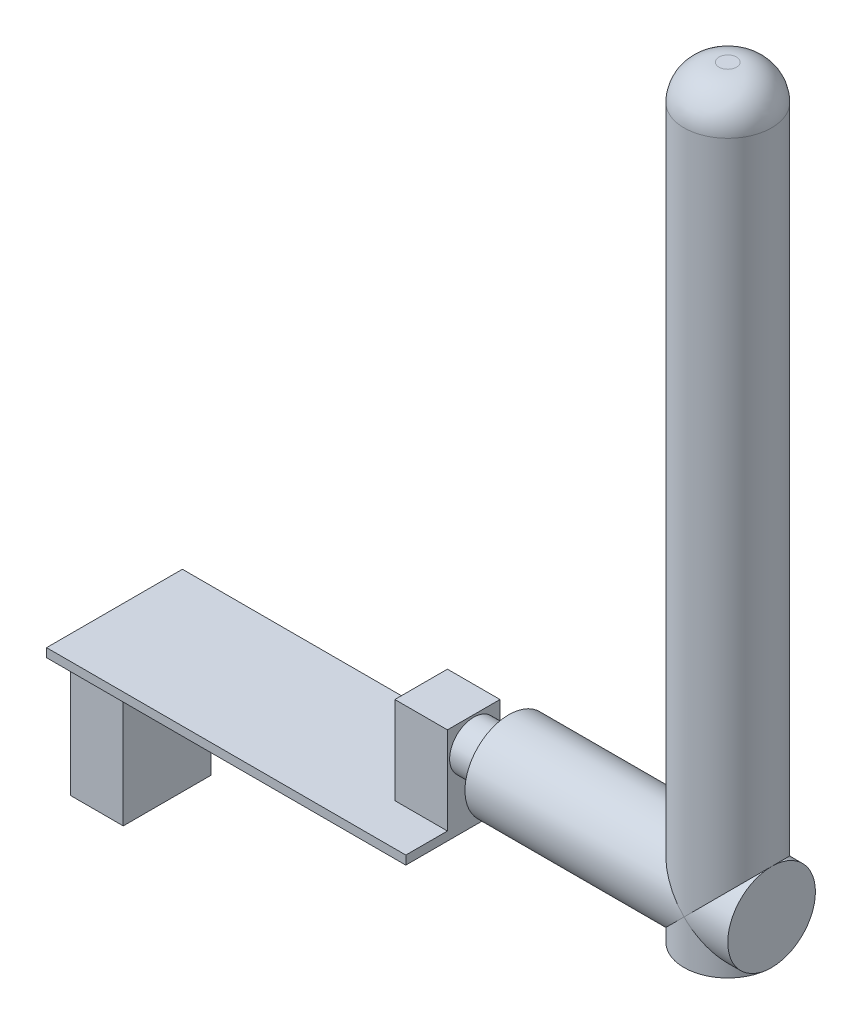
ISO-10303-21;
HEADER;
FILE_DESCRIPTION(('STEP AP214'),'2;1');
FILE_NAME('part.step','',(''),(''),'','','');
FILE_SCHEMA(('AUTOMOTIVE_DESIGN { 1 0 10303 214 1 1 1 1 }'));
ENDSEC;
DATA;
#1=APPLICATION_CONTEXT('core data for automotive mechanical design processes');
#2=APPLICATION_PROTOCOL_DEFINITION('international standard','automotive_design',2000,#1);
#3=PRODUCT_CONTEXT('',#1,'mechanical');
#4=PRODUCT('Part','Part','',(#3));
#5=PRODUCT_RELATED_PRODUCT_CATEGORY('part','',(#4));
#6=PRODUCT_DEFINITION_FORMATION('','',#4);
#7=PRODUCT_DEFINITION_CONTEXT('part definition',#1,'design');
#8=PRODUCT_DEFINITION('design','',#6,#7);
#9=PRODUCT_DEFINITION_SHAPE('','',#8);
#10=(LENGTH_UNIT() NAMED_UNIT(*) SI_UNIT(.MILLI.,.METRE.));
#11=(NAMED_UNIT(*) PLANE_ANGLE_UNIT() SI_UNIT($,.RADIAN.));
#12=(NAMED_UNIT(*) SI_UNIT($,.STERADIAN.) SOLID_ANGLE_UNIT());
#13=UNCERTAINTY_MEASURE_WITH_UNIT(LENGTH_MEASURE(1.E-05),#10,'distance_accuracy_value','');
#14=(GEOMETRIC_REPRESENTATION_CONTEXT(3) GLOBAL_UNCERTAINTY_ASSIGNED_CONTEXT((#13)) GLOBAL_UNIT_ASSIGNED_CONTEXT((#10,
#11,#12)) REPRESENTATION_CONTEXT('',''));
#15=CARTESIAN_POINT('',(0.,0.,0.));
#16=DIRECTION('',(0.,0.,1.));
#17=DIRECTION('',(1.,0.,0.));
#18=AXIS2_PLACEMENT_3D('',#15,#16,#17);
#19=CARTESIAN_POINT('',(0.,-1.,0.));
#20=DIRECTION('',(0.,1.,0.));
#21=DIRECTION('',(0.,0.,1.));
#22=AXIS2_PLACEMENT_3D('',#19,#20,#21);
#23=PLANE('',#22);
#24=DIRECTION('',(1.,0.,0.));
#25=VECTOR('',#24,1.);
#26=CARTESIAN_POINT('',(-20.5,-1.,-5.));
#27=LINE('',#26,#25);
#28=CARTESIAN_POINT('',(-20.5,-1.,-5.));
#29=VERTEX_POINT('',#28);
#30=CARTESIAN_POINT('',(-14.5,-1.,-5.));
#31=VERTEX_POINT('',#30);
#32=EDGE_CURVE('E177',#29,#31,#27,.T.);
#33=ORIENTED_EDGE('',*,*,#32,.F.);
#34=DIRECTION('',(0.,0.,1.));
#35=VECTOR('',#34,1.);
#36=CARTESIAN_POINT('',(-20.5,-1.,-7.75));
#37=LINE('',#36,#35);
#38=CARTESIAN_POINT('',(-20.5,-1.,-7.75));
#39=VERTEX_POINT('',#38);
#40=EDGE_CURVE('E281',#39,#29,#37,.T.);
#41=ORIENTED_EDGE('',*,*,#40,.F.);
#42=DIRECTION('',(-1.,0.,0.));
#43=VECTOR('',#42,1.);
#44=CARTESIAN_POINT('',(-20.5,-1.,-7.75));
#45=LINE('',#44,#43);
#46=CARTESIAN_POINT('',(20.5,-1.,-7.75));
#47=VERTEX_POINT('',#46);
#48=EDGE_CURVE('E275',#47,#39,#45,.T.);
#49=ORIENTED_EDGE('',*,*,#48,.F.);
#50=DIRECTION('',(0.,0.,-1.));
#51=VECTOR('',#50,1.);
#52=CARTESIAN_POINT('',(20.5,-1.,-7.75));
#53=LINE('',#52,#51);
#54=CARTESIAN_POINT('',(20.5,-1.,7.75));
#55=VERTEX_POINT('',#54);
#56=EDGE_CURVE('E271',#55,#47,#53,.T.);
#57=ORIENTED_EDGE('',*,*,#56,.F.);
#58=DIRECTION('',(1.,0.,0.));
#59=VECTOR('',#58,1.);
#60=CARTESIAN_POINT('',(-20.5,-1.,7.75));
#61=LINE('',#60,#59);
#62=CARTESIAN_POINT('',(-20.5,-1.,7.75));
#63=VERTEX_POINT('',#62);
#64=EDGE_CURVE('E285',#63,#55,#61,.T.);
#65=ORIENTED_EDGE('',*,*,#64,.F.);
#66=CARTESIAN_POINT('',(-20.5,-1.,5.));
#67=VERTEX_POINT('',#66);
#68=EDGE_CURVE('E280',#67,#63,#37,.T.);
#69=ORIENTED_EDGE('',*,*,#68,.F.);
#70=DIRECTION('',(-1.,0.,0.));
#71=VECTOR('',#70,1.);
#72=CARTESIAN_POINT('',(-20.5,-1.,5.));
#73=LINE('',#72,#71);
#74=CARTESIAN_POINT('',(-14.5,-1.,5.));
#75=VERTEX_POINT('',#74);
#76=EDGE_CURVE('E74',#75,#67,#73,.T.);
#77=ORIENTED_EDGE('',*,*,#76,.F.);
#78=DIRECTION('',(0.,0.,1.));
#79=VECTOR('',#78,1.);
#80=CARTESIAN_POINT('',(-14.5,-1.,5.));
#81=LINE('',#80,#79);
#82=EDGE_CURVE('E69',#31,#75,#81,.T.);
#83=ORIENTED_EDGE('',*,*,#82,.F.);
#84=EDGE_LOOP('',(#33,#41,#49,#57,#65,#69,#77,#83));
#85=FACE_BOUND('',#84,.T.);
#86=ADVANCED_FACE('F53',(#85),#23,.F.);
#87=CARTESIAN_POINT('',(54.5,7.,0.));
#88=DIRECTION('',(-1.,0.,0.));
#89=DIRECTION('',(0.,0.,1.));
#90=AXIS2_PLACEMENT_3D('',#87,#88,#89);
#91=CYLINDRICAL_SURFACE('',#90,5.);
#92=CARTESIAN_POINT('',(24.5,7.,0.));
#93=DIRECTION('',(1.,0.,0.));
#94=DIRECTION('',(0.,0.,-1.));
#95=AXIS2_PLACEMENT_3D('',#92,#93,#94);
#96=CIRCLE('',#95,5.);
#97=CARTESIAN_POINT('',(24.5,7.,-5.));
#98=VERTEX_POINT('',#97);
#99=EDGE_CURVE('E218',#98,#98,#96,.T.);
#100=ORIENTED_EDGE('',*,*,#99,.T.);
#101=EDGE_LOOP('',(#100));
#102=FACE_BOUND('',#101,.T.);
#103=CARTESIAN_POINT('',(49.5,7.,0.));
#104=DIRECTION('',(-0.707106781186547,-0.707106781186547,0.));
#105=DIRECTION('',(-0.707106781186547,0.707106781186547,0.));
#106=AXIS2_PLACEMENT_3D('',#103,#104,#105);
#107=ELLIPSE('',#106,7.07106781186547,5.);
#108=CARTESIAN_POINT('',(49.5,7.,5.));
#109=VERTEX_POINT('',#108);
#110=CARTESIAN_POINT('',(49.5,7.,-5.));
#111=VERTEX_POINT('',#110);
#112=EDGE_CURVE('E203',#109,#111,#107,.T.);
#113=ORIENTED_EDGE('',*,*,#112,.T.);
#114=CARTESIAN_POINT('',(49.5,7.,0.));
#115=DIRECTION('',(-0.707106781186547,0.707106781186547,0.));
#116=DIRECTION('',(-0.707106781186547,-0.707106781186547,0.));
#117=AXIS2_PLACEMENT_3D('',#114,#115,#116);
#118=ELLIPSE('',#117,7.07106781186547,5.);
#119=CARTESIAN_POINT('',(44.5,2.,0.));
#120=VERTEX_POINT('',#119);
#121=EDGE_CURVE('E202',#111,#120,#118,.T.);
#122=ORIENTED_EDGE('',*,*,#121,.T.);
#123=EDGE_CURVE('E197',#120,#109,#118,.T.);
#124=ORIENTED_EDGE('',*,*,#123,.T.);
#125=EDGE_LOOP('',(#113,#122,#124));
#126=FACE_BOUND('',#125,.T.);
#127=ADVANCED_FACE('F333',(#102,#126),#91,.T.);
#128=CARTESIAN_POINT('',(20.5,-1.,-7.75));
#129=DIRECTION('',(1.,0.,0.));
#130=DIRECTION('',(0.,0.,-1.));
#131=AXIS2_PLACEMENT_3D('',#128,#129,#130);
#132=PLANE('',#131);
#133=CARTESIAN_POINT('',(20.5,7.,0.));
#134=DIRECTION('',(1.,0.,0.));
#135=DIRECTION('',(0.,0.,-1.));
#136=AXIS2_PLACEMENT_3D('',#133,#134,#135);
#137=CIRCLE('',#136,2.75);
#138=CARTESIAN_POINT('',(20.5,7.,-2.75));
#139=VERTEX_POINT('',#138);
#140=EDGE_CURVE('E216',#139,#139,#137,.T.);
#141=ORIENTED_EDGE('',*,*,#140,.F.);
#142=EDGE_LOOP('',(#141));
#143=FACE_BOUND('',#142,.T.);
#144=DIRECTION('',(0.,0.,-1.));
#145=VECTOR('',#144,1.);
#146=CARTESIAN_POINT('',(20.5,0.,-7.75));
#147=LINE('',#146,#145);
#148=CARTESIAN_POINT('',(20.5,0.,7.75));
#149=VERTEX_POINT('',#148);
#150=CARTESIAN_POINT('',(20.5,0.,3.));
#151=VERTEX_POINT('',#150);
#152=EDGE_CURVE('E290',#149,#151,#147,.T.);
#153=ORIENTED_EDGE('',*,*,#152,.F.);
#154=DIRECTION('',(0.,1.,0.));
#155=VECTOR('',#154,1.);
#156=CARTESIAN_POINT('',(20.5,-1.,7.75));
#157=LINE('',#156,#155);
#158=EDGE_CURVE('E304',#55,#149,#157,.T.);
#159=ORIENTED_EDGE('',*,*,#158,.F.);
#160=ORIENTED_EDGE('',*,*,#56,.T.);
#161=DIRECTION('',(0.,1.,0.));
#162=VECTOR('',#161,1.);
#163=CARTESIAN_POINT('',(20.5,-1.,-7.75));
#164=LINE('',#163,#162);
#165=CARTESIAN_POINT('',(20.5,0.,-7.75));
#166=VERTEX_POINT('',#165);
#167=EDGE_CURVE('E289',#47,#166,#164,.T.);
#168=ORIENTED_EDGE('',*,*,#167,.T.);
#169=CARTESIAN_POINT('',(20.5,0.,-3.));
#170=VERTEX_POINT('',#169);
#171=EDGE_CURVE('E270',#170,#166,#147,.T.);
#172=ORIENTED_EDGE('',*,*,#171,.F.);
#173=DIRECTION('',(0.,-1.,0.));
#174=VECTOR('',#173,1.);
#175=CARTESIAN_POINT('',(20.5,10.,-3.));
#176=LINE('',#175,#174);
#177=CARTESIAN_POINT('',(20.5,10.,-3.));
#178=VERTEX_POINT('',#177);
#179=EDGE_CURVE('E266',#178,#170,#176,.T.);
#180=ORIENTED_EDGE('',*,*,#179,.F.);
#181=DIRECTION('',(0.,0.,-1.));
#182=VECTOR('',#181,1.);
#183=CARTESIAN_POINT('',(20.5,10.,-3.));
#184=LINE('',#183,#182);
#185=CARTESIAN_POINT('',(20.5,10.,3.));
#186=VERTEX_POINT('',#185);
#187=EDGE_CURVE('E230',#186,#178,#184,.T.);
#188=ORIENTED_EDGE('',*,*,#187,.F.);
#189=DIRECTION('',(0.,-1.,0.));
#190=VECTOR('',#189,1.);
#191=CARTESIAN_POINT('',(20.5,10.,3.));
#192=LINE('',#191,#190);
#193=EDGE_CURVE('E244',#186,#151,#192,.T.);
#194=ORIENTED_EDGE('',*,*,#193,.T.);
#195=EDGE_LOOP('',(#153,#159,#160,#168,#172,#180,#188,#194));
#196=FACE_BOUND('',#195,.T.);
#197=ADVANCED_FACE('F340',(#143,#196),#132,.T.);
#198=CARTESIAN_POINT('',(-20.5,-1.,7.75));
#199=DIRECTION('',(0.,0.,1.));
#200=DIRECTION('',(1.,0.,0.));
#201=AXIS2_PLACEMENT_3D('',#198,#199,#200);
#202=PLANE('',#201);
#203=DIRECTION('',(1.,0.,0.));
#204=VECTOR('',#203,1.);
#205=CARTESIAN_POINT('',(-20.5,0.,7.75));
#206=LINE('',#205,#204);
#207=CARTESIAN_POINT('',(-20.5,0.,7.75));
#208=VERTEX_POINT('',#207);
#209=EDGE_CURVE('E276',#208,#149,#206,.T.);
#210=ORIENTED_EDGE('',*,*,#209,.F.);
#211=DIRECTION('',(0.,1.,0.));
#212=VECTOR('',#211,1.);
#213=CARTESIAN_POINT('',(-20.5,-1.,7.75));
#214=LINE('',#213,#212);
#215=EDGE_CURVE('E307',#63,#208,#214,.T.);
#216=ORIENTED_EDGE('',*,*,#215,.F.);
#217=ORIENTED_EDGE('',*,*,#64,.T.);
#218=ORIENTED_EDGE('',*,*,#158,.T.);
#219=EDGE_LOOP('',(#210,#216,#217,#218));
#220=FACE_BOUND('',#219,.T.);
#221=ADVANCED_FACE('F351',(#220),#202,.T.);
#222=CARTESIAN_POINT('',(-20.5,-1.,-7.75));
#223=DIRECTION('',(-1.,0.,0.));
#224=DIRECTION('',(0.,0.,1.));
#225=AXIS2_PLACEMENT_3D('',#222,#223,#224);
#226=PLANE('',#225);
#227=DIRECTION('',(0.,0.,1.));
#228=VECTOR('',#227,1.);
#229=CARTESIAN_POINT('',(-20.5,0.,-7.75));
#230=LINE('',#229,#228);
#231=CARTESIAN_POINT('',(-20.5,0.,-7.75));
#232=VERTEX_POINT('',#231);
#233=EDGE_CURVE('E297',#232,#208,#230,.T.);
#234=ORIENTED_EDGE('',*,*,#233,.F.);
#235=DIRECTION('',(0.,1.,0.));
#236=VECTOR('',#235,1.);
#237=CARTESIAN_POINT('',(-20.5,-1.,-7.75));
#238=LINE('',#237,#236);
#239=EDGE_CURVE('E310',#39,#232,#238,.T.);
#240=ORIENTED_EDGE('',*,*,#239,.F.);
#241=ORIENTED_EDGE('',*,*,#40,.T.);
#242=DIRECTION('',(0.,1.,0.));
#243=VECTOR('',#242,1.);
#244=CARTESIAN_POINT('',(-20.5,-16.,-5.));
#245=LINE('',#244,#243);
#246=CARTESIAN_POINT('',(-20.5,-16.,-5.));
#247=VERTEX_POINT('',#246);
#248=EDGE_CURVE('E188',#247,#29,#245,.T.);
#249=ORIENTED_EDGE('',*,*,#248,.F.);
#250=DIRECTION('',(0.,0.,-1.));
#251=VECTOR('',#250,1.);
#252=CARTESIAN_POINT('',(-20.5,-16.,5.));
#253=LINE('',#252,#251);
#254=CARTESIAN_POINT('',(-20.5,-16.,5.));
#255=VERTEX_POINT('',#254);
#256=EDGE_CURVE('E166',#255,#247,#253,.T.);
#257=ORIENTED_EDGE('',*,*,#256,.F.);
#258=DIRECTION('',(0.,1.,0.));
#259=VECTOR('',#258,1.);
#260=CARTESIAN_POINT('',(-20.5,-16.,5.));
#261=LINE('',#260,#259);
#262=EDGE_CURVE('E162',#255,#67,#261,.T.);
#263=ORIENTED_EDGE('',*,*,#262,.T.);
#264=ORIENTED_EDGE('',*,*,#68,.T.);
#265=ORIENTED_EDGE('',*,*,#215,.T.);
#266=EDGE_LOOP('',(#234,#240,#241,#249,#257,#263,#264,#265));
#267=FACE_BOUND('',#266,.T.);
#268=ADVANCED_FACE('F354',(#267),#226,.T.);
#269=CARTESIAN_POINT('',(-20.5,-1.,-7.75));
#270=DIRECTION('',(0.,0.,-1.));
#271=DIRECTION('',(-1.,0.,0.));
#272=AXIS2_PLACEMENT_3D('',#269,#270,#271);
#273=PLANE('',#272);
#274=DIRECTION('',(-1.,0.,0.));
#275=VECTOR('',#274,1.);
#276=CARTESIAN_POINT('',(-20.5,0.,-7.75));
#277=LINE('',#276,#275);
#278=EDGE_CURVE('E293',#166,#232,#277,.T.);
#279=ORIENTED_EDGE('',*,*,#278,.F.);
#280=ORIENTED_EDGE('',*,*,#167,.F.);
#281=ORIENTED_EDGE('',*,*,#48,.T.);
#282=ORIENTED_EDGE('',*,*,#239,.T.);
#283=EDGE_LOOP('',(#279,#280,#281,#282));
#284=FACE_BOUND('',#283,.T.);
#285=ADVANCED_FACE('F349',(#284),#273,.T.);
#286=CARTESIAN_POINT('',(0.,0.,0.));
#287=DIRECTION('',(0.,1.,0.));
#288=DIRECTION('',(0.,0.,1.));
#289=AXIS2_PLACEMENT_3D('',#286,#287,#288);
#290=PLANE('',#289);
#291=DIRECTION('',(1.,0.,0.));
#292=VECTOR('',#291,1.);
#293=CARTESIAN_POINT('',(14.5,0.,3.));
#294=LINE('',#293,#292);
#295=CARTESIAN_POINT('',(14.5,0.,3.));
#296=VERTEX_POINT('',#295);
#297=EDGE_CURVE('E235',#296,#151,#294,.T.);
#298=ORIENTED_EDGE('',*,*,#297,.F.);
#299=DIRECTION('',(0.,0.,1.));
#300=VECTOR('',#299,1.);
#301=CARTESIAN_POINT('',(14.5,0.,-3.));
#302=LINE('',#301,#300);
#303=CARTESIAN_POINT('',(14.5,0.,-3.));
#304=VERTEX_POINT('',#303);
#305=EDGE_CURVE('E248',#304,#296,#302,.T.);
#306=ORIENTED_EDGE('',*,*,#305,.F.);
#307=DIRECTION('',(-1.,0.,0.));
#308=VECTOR('',#307,1.);
#309=CARTESIAN_POINT('',(14.5,0.,-3.));
#310=LINE('',#309,#308);
#311=EDGE_CURVE('E226',#170,#304,#310,.T.);
#312=ORIENTED_EDGE('',*,*,#311,.F.);
#313=ORIENTED_EDGE('',*,*,#171,.T.);
#314=ORIENTED_EDGE('',*,*,#278,.T.);
#315=ORIENTED_EDGE('',*,*,#233,.T.);
#316=ORIENTED_EDGE('',*,*,#209,.T.);
#317=ORIENTED_EDGE('',*,*,#152,.T.);
#318=EDGE_LOOP('',(#298,#306,#312,#313,#314,#315,#316,#317));
#319=FACE_BOUND('',#318,.T.);
#320=ADVANCED_FACE('F346',(#319),#290,.T.);
#321=CARTESIAN_POINT('',(14.5,10.,-3.));
#322=DIRECTION('',(0.,0.,1.));
#323=DIRECTION('',(1.,0.,0.));
#324=AXIS2_PLACEMENT_3D('',#321,#322,#323);
#325=PLANE('',#324);
#326=ORIENTED_EDGE('',*,*,#311,.T.);
#327=DIRECTION('',(0.,-1.,0.));
#328=VECTOR('',#327,1.);
#329=CARTESIAN_POINT('',(14.5,10.,-3.));
#330=LINE('',#329,#328);
#331=CARTESIAN_POINT('',(14.5,10.,-3.));
#332=VERTEX_POINT('',#331);
#333=EDGE_CURVE('E262',#332,#304,#330,.T.);
#334=ORIENTED_EDGE('',*,*,#333,.F.);
#335=DIRECTION('',(-1.,0.,0.));
#336=VECTOR('',#335,1.);
#337=CARTESIAN_POINT('',(14.5,10.,-3.));
#338=LINE('',#337,#336);
#339=EDGE_CURVE('E234',#178,#332,#338,.T.);
#340=ORIENTED_EDGE('',*,*,#339,.F.);
#341=ORIENTED_EDGE('',*,*,#179,.T.);
#342=EDGE_LOOP('',(#326,#334,#340,#341));
#343=FACE_BOUND('',#342,.T.);
#344=ADVANCED_FACE('F344',(#343),#325,.F.);
#345=CARTESIAN_POINT('',(14.5,10.,-3.));
#346=DIRECTION('',(1.,0.,0.));
#347=DIRECTION('',(0.,0.,-1.));
#348=AXIS2_PLACEMENT_3D('',#345,#346,#347);
#349=PLANE('',#348);
#350=ORIENTED_EDGE('',*,*,#305,.T.);
#351=DIRECTION('',(0.,-1.,0.));
#352=VECTOR('',#351,1.);
#353=CARTESIAN_POINT('',(14.5,10.,3.));
#354=LINE('',#353,#352);
#355=CARTESIAN_POINT('',(14.5,10.,3.));
#356=VERTEX_POINT('',#355);
#357=EDGE_CURVE('E258',#356,#296,#354,.T.);
#358=ORIENTED_EDGE('',*,*,#357,.F.);
#359=DIRECTION('',(0.,0.,1.));
#360=VECTOR('',#359,1.);
#361=CARTESIAN_POINT('',(14.5,10.,-3.));
#362=LINE('',#361,#360);
#363=EDGE_CURVE('E238',#332,#356,#362,.T.);
#364=ORIENTED_EDGE('',*,*,#363,.F.);
#365=ORIENTED_EDGE('',*,*,#333,.T.);
#366=EDGE_LOOP('',(#350,#358,#364,#365));
#367=FACE_BOUND('',#366,.T.);
#368=ADVANCED_FACE('F433',(#367),#349,.F.);
#369=CARTESIAN_POINT('',(14.5,10.,3.));
#370=DIRECTION('',(0.,0.,-1.));
#371=DIRECTION('',(-1.,0.,0.));
#372=AXIS2_PLACEMENT_3D('',#369,#370,#371);
#373=PLANE('',#372);
#374=ORIENTED_EDGE('',*,*,#297,.T.);
#375=ORIENTED_EDGE('',*,*,#193,.F.);
#376=DIRECTION('',(1.,0.,0.));
#377=VECTOR('',#376,1.);
#378=CARTESIAN_POINT('',(14.5,10.,3.));
#379=LINE('',#378,#377);
#380=EDGE_CURVE('E241',#356,#186,#379,.T.);
#381=ORIENTED_EDGE('',*,*,#380,.F.);
#382=ORIENTED_EDGE('',*,*,#357,.T.);
#383=EDGE_LOOP('',(#374,#375,#381,#382));
#384=FACE_BOUND('',#383,.T.);
#385=ADVANCED_FACE('F430',(#384),#373,.F.);
#386=CARTESIAN_POINT('',(0.,10.,0.));
#387=DIRECTION('',(0.,1.,0.));
#388=DIRECTION('',(0.,0.,1.));
#389=AXIS2_PLACEMENT_3D('',#386,#387,#388);
#390=PLANE('',#389);
#391=ORIENTED_EDGE('',*,*,#187,.T.);
#392=ORIENTED_EDGE('',*,*,#339,.T.);
#393=ORIENTED_EDGE('',*,*,#363,.T.);
#394=ORIENTED_EDGE('',*,*,#380,.T.);
#395=EDGE_LOOP('',(#391,#392,#393,#394));
#396=FACE_BOUND('',#395,.T.);
#397=ADVANCED_FACE('F426',(#396),#390,.T.);
#398=CARTESIAN_POINT('',(24.5,7.,0.));
#399=DIRECTION('',(-1.,0.,0.));
#400=DIRECTION('',(0.,0.,1.));
#401=AXIS2_PLACEMENT_3D('',#398,#399,#400);
#402=CYLINDRICAL_SURFACE('',#401,2.75);
#403=CARTESIAN_POINT('',(24.5,7.,0.));
#404=DIRECTION('',(1.,0.,0.));
#405=DIRECTION('',(0.,0.,-1.));
#406=AXIS2_PLACEMENT_3D('',#403,#404,#405);
#407=CIRCLE('',#406,2.75);
#408=CARTESIAN_POINT('',(24.5,7.,-2.75));
#409=VERTEX_POINT('',#408);
#410=EDGE_CURVE('E222',#409,#409,#407,.T.);
#411=ORIENTED_EDGE('',*,*,#410,.F.);
#412=EDGE_LOOP('',(#411));
#413=FACE_BOUND('',#412,.T.);
#414=ORIENTED_EDGE('',*,*,#140,.T.);
#415=EDGE_LOOP('',(#414));
#416=FACE_BOUND('',#415,.T.);
#417=ADVANCED_FACE('F420',(#413,#416),#402,.T.);
#418=CARTESIAN_POINT('',(24.5,7.,0.));
#419=DIRECTION('',(1.,0.,0.));
#420=DIRECTION('',(0.,0.,-1.));
#421=AXIS2_PLACEMENT_3D('',#418,#419,#420);
#422=PLANE('',#421);
#423=ORIENTED_EDGE('',*,*,#410,.T.);
#424=EDGE_LOOP('',(#423));
#425=FACE_BOUND('',#424,.T.);
#426=ORIENTED_EDGE('',*,*,#99,.F.);
#427=EDGE_LOOP('',(#426));
#428=FACE_BOUND('',#427,.T.);
#429=ADVANCED_FACE('F418',(#425,#428),#422,.F.);
#430=CARTESIAN_POINT('',(49.5,89.,0.));
#431=DIRECTION('',(0.,-1.,0.));
#432=DIRECTION('',(0.,0.,-1.));
#433=AXIS2_PLACEMENT_3D('',#430,#431,#432);
#434=PLANE('',#433);
#435=CARTESIAN_POINT('',(49.5,89.,0.));
#436=DIRECTION('',(0.,-1.,0.));
#437=DIRECTION('',(0.,0.,-1.));
#438=AXIS2_PLACEMENT_3D('',#435,#436,#437);
#439=CIRCLE('',#438,0.999999999999997);
#440=CARTESIAN_POINT('',(49.5,89.,-0.999999999999992));
#441=VERTEX_POINT('',#440);
#442=EDGE_CURVE('E13',#441,#441,#439,.F.);
#443=ORIENTED_EDGE('',*,*,#442,.T.);
#444=EDGE_LOOP('',(#443));
#445=FACE_BOUND('',#444,.T.);
#446=ADVANCED_FACE('F415',(#445),#434,.F.);
#447=CARTESIAN_POINT('',(49.5,89.,0.));
#448=DIRECTION('',(0.,-1.,0.));
#449=DIRECTION('',(0.,0.,-1.));
#450=AXIS2_PLACEMENT_3D('',#447,#448,#449);
#451=CYLINDRICAL_SURFACE('',#450,5.);
#452=CARTESIAN_POINT('',(49.5,85.,0.));
#453=DIRECTION('',(0.,-1.,0.));
#454=DIRECTION('',(0.,0.,-1.));
#455=AXIS2_PLACEMENT_3D('',#452,#453,#454);
#456=CIRCLE('',#455,5.);
#457=CARTESIAN_POINT('',(49.5,85.,-4.99999999999999));
#458=VERTEX_POINT('',#457);
#459=EDGE_CURVE('E62',#458,#458,#456,.T.);
#460=ORIENTED_EDGE('',*,*,#459,.T.);
#461=EDGE_LOOP('',(#460));
#462=FACE_BOUND('',#461,.T.);
#463=CARTESIAN_POINT('',(49.5,7.,0.));
#464=DIRECTION('',(-0.707106781186547,0.707106781186547,0.));
#465=DIRECTION('',(-0.707106781186547,-0.707106781186547,0.));
#466=AXIS2_PLACEMENT_3D('',#463,#464,#465);
#467=ELLIPSE('',#466,7.07106781186547,5.);
#468=CARTESIAN_POINT('',(54.5,12.,0.));
#469=VERTEX_POINT('',#468);
#470=EDGE_CURVE('E198',#111,#469,#467,.F.);
#471=ORIENTED_EDGE('',*,*,#470,.F.);
#472=ORIENTED_EDGE('',*,*,#112,.F.);
#473=EDGE_CURVE('E194',#469,#109,#467,.F.);
#474=ORIENTED_EDGE('',*,*,#473,.F.);
#475=EDGE_LOOP('',(#471,#472,#474));
#476=FACE_BOUND('',#475,.T.);
#477=ADVANCED_FACE('F319',(#462,#476),#451,.T.);
#478=CARTESIAN_POINT('',(49.5,7.,0.));
#479=DIRECTION('',(-0.707106781186547,-0.707106781186547,0.));
#480=DIRECTION('',(-0.707106781186547,0.707106781186547,0.));
#481=AXIS2_PLACEMENT_3D('',#478,#479,#480);
#482=ELLIPSE('',#481,7.07106781186547,5.);
#483=CARTESIAN_POINT('',(54.5,2.,0.));
#484=VERTEX_POINT('',#483);
#485=EDGE_CURVE('E211',#109,#484,#482,.F.);
#486=ORIENTED_EDGE('',*,*,#485,.F.);
#487=ORIENTED_EDGE('',*,*,#123,.F.);
#488=CARTESIAN_POINT('',(49.5,2.,0.));
#489=DIRECTION('',(0.,-1.,0.));
#490=DIRECTION('',(0.,0.,-1.));
#491=AXIS2_PLACEMENT_3D('',#488,#489,#490);
#492=CIRCLE('',#491,5.);
#493=EDGE_CURVE('E186',#484,#120,#492,.T.);
#494=ORIENTED_EDGE('',*,*,#493,.F.);
#495=EDGE_LOOP('',(#486,#487,#494));
#496=FACE_BOUND('',#495,.T.);
#497=ADVANCED_FACE('F403',(#496),#451,.T.);
#498=EDGE_CURVE('E207',#484,#111,#482,.F.);
#499=ORIENTED_EDGE('',*,*,#498,.F.);
#500=EDGE_CURVE('E181',#120,#484,#492,.T.);
#501=ORIENTED_EDGE('',*,*,#500,.F.);
#502=ORIENTED_EDGE('',*,*,#121,.F.);
#503=EDGE_LOOP('',(#499,#501,#502));
#504=FACE_BOUND('',#503,.T.);
#505=ADVANCED_FACE('F394',(#504),#451,.T.);
#506=CARTESIAN_POINT('',(49.5,2.,0.));
#507=DIRECTION('',(0.,-1.,0.));
#508=DIRECTION('',(0.,0.,-1.));
#509=AXIS2_PLACEMENT_3D('',#506,#507,#508);
#510=PLANE('',#509);
#511=ORIENTED_EDGE('',*,*,#493,.T.);
#512=ORIENTED_EDGE('',*,*,#500,.T.);
#513=EDGE_LOOP('',(#511,#512));
#514=FACE_BOUND('',#513,.T.);
#515=ADVANCED_FACE('F405',(#514),#510,.T.);
#516=CARTESIAN_POINT('',(54.5,7.,0.));
#517=DIRECTION('',(1.,0.,0.));
#518=DIRECTION('',(0.,0.,-1.));
#519=AXIS2_PLACEMENT_3D('',#516,#517,#518);
#520=PLANE('',#519);
#521=CARTESIAN_POINT('',(54.5,7.,0.));
#522=DIRECTION('',(1.,0.,0.));
#523=DIRECTION('',(0.,0.,-1.));
#524=AXIS2_PLACEMENT_3D('',#521,#522,#523);
#525=CIRCLE('',#524,5.);
#526=EDGE_CURVE('E212',#469,#484,#525,.T.);
#527=ORIENTED_EDGE('',*,*,#526,.T.);
#528=EDGE_CURVE('E217',#484,#469,#525,.T.);
#529=ORIENTED_EDGE('',*,*,#528,.T.);
#530=EDGE_LOOP('',(#527,#529));
#531=FACE_BOUND('',#530,.T.);
#532=ADVANCED_FACE('F399',(#531),#520,.T.);
#533=ORIENTED_EDGE('',*,*,#526,.F.);
#534=ORIENTED_EDGE('',*,*,#473,.T.);
#535=ORIENTED_EDGE('',*,*,#485,.T.);
#536=EDGE_LOOP('',(#533,#534,#535));
#537=FACE_BOUND('',#536,.T.);
#538=ADVANCED_FACE('F330',(#537),#91,.T.);
#539=ORIENTED_EDGE('',*,*,#498,.T.);
#540=ORIENTED_EDGE('',*,*,#470,.T.);
#541=ORIENTED_EDGE('',*,*,#528,.F.);
#542=EDGE_LOOP('',(#539,#540,#541));
#543=FACE_BOUND('',#542,.T.);
#544=ADVANCED_FACE('F323',(#543),#91,.T.);
#545=CARTESIAN_POINT('',(49.5,85.,0.));
#546=DIRECTION('',(0.,-1.,0.));
#547=DIRECTION('',(0.,0.,-1.));
#548=AXIS2_PLACEMENT_3D('',#545,#546,#547);
#549=DEGENERATE_TOROIDAL_SURFACE('',#548,0.999999999999997,4.,.T.);
#550=ORIENTED_EDGE('',*,*,#442,.F.);
#551=EDGE_LOOP('',(#550));
#552=FACE_BOUND('',#551,.T.);
#553=ORIENTED_EDGE('',*,*,#459,.F.);
#554=EDGE_LOOP('',(#553));
#555=FACE_BOUND('',#554,.T.);
#556=ADVANCED_FACE('F55',(#552,#555),#549,.T.);
#557=CARTESIAN_POINT('',(-14.5,-16.,5.));
#558=DIRECTION('',(-1.,0.,0.));
#559=DIRECTION('',(0.,0.,1.));
#560=AXIS2_PLACEMENT_3D('',#557,#558,#559);
#561=PLANE('',#560);
#562=ORIENTED_EDGE('',*,*,#82,.T.);
#563=DIRECTION('',(0.,1.,0.));
#564=VECTOR('',#563,1.);
#565=CARTESIAN_POINT('',(-14.5,-16.,5.));
#566=LINE('',#565,#564);
#567=CARTESIAN_POINT('',(-14.5,-16.,5.));
#568=VERTEX_POINT('',#567);
#569=EDGE_CURVE('E160',#568,#75,#566,.T.);
#570=ORIENTED_EDGE('',*,*,#569,.F.);
#571=DIRECTION('',(0.,0.,1.));
#572=VECTOR('',#571,1.);
#573=CARTESIAN_POINT('',(-14.5,-16.,5.));
#574=LINE('',#573,#572);
#575=CARTESIAN_POINT('',(-14.5,-16.,-5.));
#576=VERTEX_POINT('',#575);
#577=EDGE_CURVE('E167',#576,#568,#574,.T.);
#578=ORIENTED_EDGE('',*,*,#577,.F.);
#579=DIRECTION('',(0.,1.,0.));
#580=VECTOR('',#579,1.);
#581=CARTESIAN_POINT('',(-14.5,-16.,-5.));
#582=LINE('',#581,#580);
#583=EDGE_CURVE('E620',#576,#31,#582,.T.);
#584=ORIENTED_EDGE('',*,*,#583,.T.);
#585=EDGE_LOOP('',(#562,#570,#578,#584));
#586=FACE_BOUND('',#585,.T.);
#587=ADVANCED_FACE('F179',(#586),#561,.F.);
#588=CARTESIAN_POINT('',(-20.5,-16.,5.));
#589=DIRECTION('',(0.,0.,-1.));
#590=DIRECTION('',(-1.,0.,0.));
#591=AXIS2_PLACEMENT_3D('',#588,#589,#590);
#592=PLANE('',#591);
#593=ORIENTED_EDGE('',*,*,#76,.T.);
#594=ORIENTED_EDGE('',*,*,#262,.F.);
#595=DIRECTION('',(-1.,0.,0.));
#596=VECTOR('',#595,1.);
#597=CARTESIAN_POINT('',(-20.5,-16.,5.));
#598=LINE('',#597,#596);
#599=EDGE_CURVE('E156',#568,#255,#598,.T.);
#600=ORIENTED_EDGE('',*,*,#599,.F.);
#601=ORIENTED_EDGE('',*,*,#569,.T.);
#602=EDGE_LOOP('',(#593,#594,#600,#601));
#603=FACE_BOUND('',#602,.T.);
#604=ADVANCED_FACE('F158',(#603),#592,.F.);
#605=CARTESIAN_POINT('',(-20.5,-16.,-5.));
#606=DIRECTION('',(0.,0.,1.));
#607=DIRECTION('',(1.,0.,0.));
#608=AXIS2_PLACEMENT_3D('',#605,#606,#607);
#609=PLANE('',#608);
#610=ORIENTED_EDGE('',*,*,#32,.T.);
#611=ORIENTED_EDGE('',*,*,#583,.F.);
#612=DIRECTION('',(1.,0.,0.));
#613=VECTOR('',#612,1.);
#614=CARTESIAN_POINT('',(-20.5,-16.,-5.));
#615=LINE('',#614,#613);
#616=EDGE_CURVE('E172',#247,#576,#615,.T.);
#617=ORIENTED_EDGE('',*,*,#616,.F.);
#618=ORIENTED_EDGE('',*,*,#248,.T.);
#619=EDGE_LOOP('',(#610,#611,#617,#618));
#620=FACE_BOUND('',#619,.T.);
#621=ADVANCED_FACE('F598',(#620),#609,.F.);
#622=CARTESIAN_POINT('',(0.,-16.,0.));
#623=DIRECTION('',(0.,-1.,0.));
#624=DIRECTION('',(0.,0.,-1.));
#625=AXIS2_PLACEMENT_3D('',#622,#623,#624);
#626=PLANE('',#625);
#627=ORIENTED_EDGE('',*,*,#577,.T.);
#628=ORIENTED_EDGE('',*,*,#599,.T.);
#629=ORIENTED_EDGE('',*,*,#256,.T.);
#630=ORIENTED_EDGE('',*,*,#616,.T.);
#631=EDGE_LOOP('',(#627,#628,#629,#630));
#632=FACE_BOUND('',#631,.T.);
#633=ADVANCED_FACE('F170',(#632),#626,.T.);
#634=CLOSED_SHELL('',(#86,#127,#197,#221,#268,#285,#320,#344,#368,#385,#397,#417,#429,#446,#477,
#497,#505,#515,#532,#538,#544,#556,#587,#604,#621,#633));
#635=MANIFOLD_SOLID_BREP('B2',#634);
#636=ADVANCED_BREP_SHAPE_REPRESENTATION('',(#18,#635),#14);
#637=SHAPE_DEFINITION_REPRESENTATION(#9,#636);
ENDSEC;
END-ISO-10303-21;
